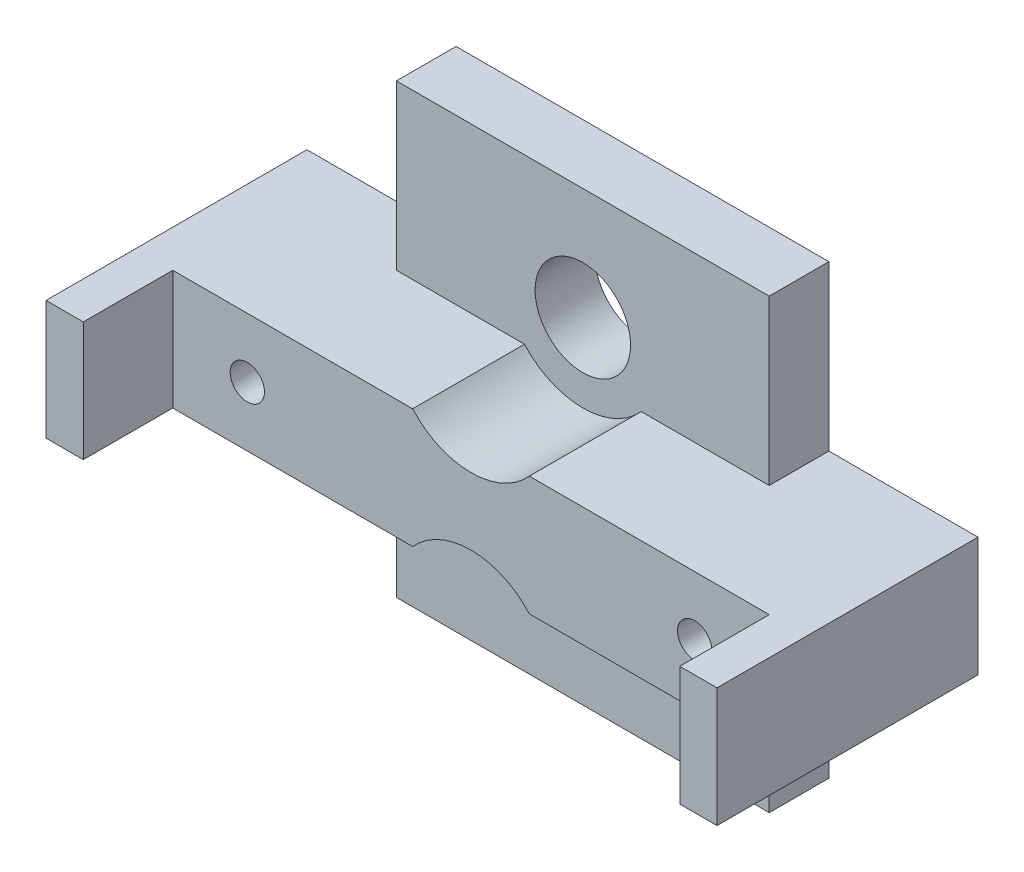
ISO-10303-21;
HEADER;
FILE_DESCRIPTION(('STEP AP214'),'2;1');
FILE_NAME('part.step','',(''),(''),'','','');
FILE_SCHEMA(('AUTOMOTIVE_DESIGN { 1 0 10303 214 1 1 1 1 }'));
ENDSEC;
DATA;
#1=APPLICATION_CONTEXT('core data for automotive mechanical design processes');
#2=APPLICATION_PROTOCOL_DEFINITION('international standard','automotive_design',2000,#1);
#3=PRODUCT_CONTEXT('',#1,'mechanical');
#4=PRODUCT('Part','Part','',(#3));
#5=PRODUCT_RELATED_PRODUCT_CATEGORY('part','',(#4));
#6=PRODUCT_DEFINITION_FORMATION('','',#4);
#7=PRODUCT_DEFINITION_CONTEXT('part definition',#1,'design');
#8=PRODUCT_DEFINITION('design','',#6,#7);
#9=PRODUCT_DEFINITION_SHAPE('','',#8);
#10=(LENGTH_UNIT() NAMED_UNIT(*) SI_UNIT(.MILLI.,.METRE.));
#11=(NAMED_UNIT(*) PLANE_ANGLE_UNIT() SI_UNIT($,.RADIAN.));
#12=(NAMED_UNIT(*) SI_UNIT($,.STERADIAN.) SOLID_ANGLE_UNIT());
#13=UNCERTAINTY_MEASURE_WITH_UNIT(LENGTH_MEASURE(1.E-05),#10,'distance_accuracy_value','');
#14=(GEOMETRIC_REPRESENTATION_CONTEXT(3) GLOBAL_UNCERTAINTY_ASSIGNED_CONTEXT((#13)) GLOBAL_UNIT_ASSIGNED_CONTEXT((#10,
#11,#12)) REPRESENTATION_CONTEXT('',''));
#15=CARTESIAN_POINT('',(0.,0.,0.));
#16=DIRECTION('',(0.,0.,1.));
#17=DIRECTION('',(1.,0.,0.));
#18=AXIS2_PLACEMENT_3D('',#15,#16,#17);
#19=CARTESIAN_POINT('',(-20.,-4.,11.5));
#20=DIRECTION('',(0.,1.,0.));
#21=DIRECTION('',(-1.,0.,0.));
#22=AXIS2_PLACEMENT_3D('',#19,#20,#21);
#23=PLANE('',#22);
#24=DIRECTION('',(0.,0.,-1.));
#25=VECTOR('',#24,1.);
#26=CARTESIAN_POINT('',(3.91311896062464,-4.,26.3492424049175));
#27=LINE('',#26,#25);
#28=CARTESIAN_POINT('',(3.91311896062464,-4.,4.));
#29=VERTEX_POINT('',#28);
#30=CARTESIAN_POINT('',(3.91311896062464,-4.,11.5));
#31=VERTEX_POINT('',#30);
#32=EDGE_CURVE('E51',#29,#31,#27,.F.);
#33=ORIENTED_EDGE('',*,*,#32,.F.);
#34=DIRECTION('',(-1.,0.,0.));
#35=VECTOR('',#34,1.);
#36=CARTESIAN_POINT('',(0.,-4.,4.));
#37=LINE('',#36,#35);
#38=CARTESIAN_POINT('',(12.5,-4.,4.));
#39=VERTEX_POINT('',#38);
#40=EDGE_CURVE('E456',#39,#29,#37,.T.);
#41=ORIENTED_EDGE('',*,*,#40,.F.);
#42=DIRECTION('',(0.,0.,-1.));
#43=VECTOR('',#42,1.);
#44=CARTESIAN_POINT('',(12.5,-4.00000000000001,4.));
#45=LINE('',#44,#43);
#46=CARTESIAN_POINT('',(12.5,-4.,0.));
#47=VERTEX_POINT('',#46);
#48=EDGE_CURVE('E11',#39,#47,#45,.T.);
#49=ORIENTED_EDGE('',*,*,#48,.T.);
#50=DIRECTION('',(-1.,0.,0.));
#51=VECTOR('',#50,1.);
#52=CARTESIAN_POINT('',(-20.,-4.,0.));
#53=LINE('',#52,#51);
#54=CARTESIAN_POINT('',(22.5,-4.00000000000001,0.));
#55=VERTEX_POINT('',#54);
#56=EDGE_CURVE('E423',#55,#47,#53,.T.);
#57=ORIENTED_EDGE('',*,*,#56,.F.);
#58=DIRECTION('',(0.,0.,-1.));
#59=VECTOR('',#58,1.);
#60=CARTESIAN_POINT('',(22.5,-4.00000000000001,17.5));
#61=LINE('',#60,#59);
#62=CARTESIAN_POINT('',(22.5,-4.00000000000001,17.5));
#63=VERTEX_POINT('',#62);
#64=EDGE_CURVE('E281',#63,#55,#61,.T.);
#65=ORIENTED_EDGE('',*,*,#64,.F.);
#66=DIRECTION('',(-1.,0.,0.));
#67=VECTOR('',#66,1.);
#68=CARTESIAN_POINT('',(20.,-4.00000000000001,17.5));
#69=LINE('',#68,#67);
#70=CARTESIAN_POINT('',(20.,-4.00000000000001,17.5));
#71=VERTEX_POINT('',#70);
#72=EDGE_CURVE('E257',#63,#71,#69,.T.);
#73=ORIENTED_EDGE('',*,*,#72,.T.);
#74=DIRECTION('',(0.,0.,-1.));
#75=VECTOR('',#74,1.);
#76=CARTESIAN_POINT('',(20.,-4.00000000000001,17.5));
#77=LINE('',#76,#75);
#78=CARTESIAN_POINT('',(20.,-4.00000000000001,11.5));
#79=VERTEX_POINT('',#78);
#80=EDGE_CURVE('E271',#71,#79,#77,.T.);
#81=ORIENTED_EDGE('',*,*,#80,.T.);
#82=DIRECTION('',(1.,0.,0.));
#83=VECTOR('',#82,1.);
#84=CARTESIAN_POINT('',(-20.,-4.,11.5));
#85=LINE('',#84,#83);
#86=EDGE_CURVE('E440',#31,#79,#85,.T.);
#87=ORIENTED_EDGE('',*,*,#86,.F.);
#88=EDGE_LOOP('',(#33,#41,#49,#57,#65,#73,#81,#87));
#89=FACE_BOUND('',#88,.T.);
#90=ADVANCED_FACE('F34',(#89),#23,.F.);
#91=DIRECTION('',(0.,0.,-1.));
#92=VECTOR('',#91,1.);
#93=CARTESIAN_POINT('',(-3.91311896062463,-4.,26.3492424049175));
#94=LINE('',#93,#92);
#95=CARTESIAN_POINT('',(-3.91311896062463,-4.,11.5));
#96=VERTEX_POINT('',#95);
#97=CARTESIAN_POINT('',(-3.91311896062463,-4.,4.));
#98=VERTEX_POINT('',#97);
#99=EDGE_CURVE('E315',#96,#98,#94,.T.);
#100=ORIENTED_EDGE('',*,*,#99,.F.);
#101=CARTESIAN_POINT('',(-20.,-4.,11.5));
#102=VERTEX_POINT('',#101);
#103=EDGE_CURVE('E441',#102,#96,#85,.T.);
#104=ORIENTED_EDGE('',*,*,#103,.F.);
#105=DIRECTION('',(0.,0.,-1.));
#106=VECTOR('',#105,1.);
#107=CARTESIAN_POINT('',(-20.,-4.,17.5));
#108=LINE('',#107,#106);
#109=CARTESIAN_POINT('',(-20.,-4.,17.5));
#110=VERTEX_POINT('',#109);
#111=EDGE_CURVE('E297',#110,#102,#108,.T.);
#112=ORIENTED_EDGE('',*,*,#111,.F.);
#113=DIRECTION('',(-1.,0.,0.));
#114=VECTOR('',#113,1.);
#115=CARTESIAN_POINT('',(-20.,-4.,17.5));
#116=LINE('',#115,#114);
#117=CARTESIAN_POINT('',(-22.5,-4.,17.5));
#118=VERTEX_POINT('',#117);
#119=EDGE_CURVE('E288',#110,#118,#116,.T.);
#120=ORIENTED_EDGE('',*,*,#119,.T.);
#121=DIRECTION('',(0.,0.,-1.));
#122=VECTOR('',#121,1.);
#123=CARTESIAN_POINT('',(-22.5,-4.,17.5));
#124=LINE('',#123,#122);
#125=CARTESIAN_POINT('',(-22.5,-4.,0.));
#126=VERTEX_POINT('',#125);
#127=EDGE_CURVE('E307',#118,#126,#124,.T.);
#128=ORIENTED_EDGE('',*,*,#127,.T.);
#129=CARTESIAN_POINT('',(-12.5,-4.,0.));
#130=VERTEX_POINT('',#129);
#131=EDGE_CURVE('E427',#130,#126,#53,.T.);
#132=ORIENTED_EDGE('',*,*,#131,.F.);
#133=DIRECTION('',(0.,0.,1.));
#134=VECTOR('',#133,1.);
#135=CARTESIAN_POINT('',(-12.5,-4.,4.));
#136=LINE('',#135,#134);
#137=CARTESIAN_POINT('',(-12.5,-3.99999999999999,4.));
#138=VERTEX_POINT('',#137);
#139=EDGE_CURVE('E459',#130,#138,#136,.T.);
#140=ORIENTED_EDGE('',*,*,#139,.T.);
#141=EDGE_CURVE('E455',#98,#138,#37,.T.);
#142=ORIENTED_EDGE('',*,*,#141,.F.);
#143=EDGE_LOOP('',(#100,#104,#112,#120,#128,#132,#140,#142));
#144=FACE_BOUND('',#143,.T.);
#145=ADVANCED_FACE('F539',(#144),#23,.F.);
#146=CARTESIAN_POINT('',(-20.,4.,11.5));
#147=DIRECTION('',(0.,-1.,0.));
#148=DIRECTION('',(1.,0.,0.));
#149=AXIS2_PLACEMENT_3D('',#146,#147,#148);
#150=PLANE('',#149);
#151=DIRECTION('',(0.,0.,-1.));
#152=VECTOR('',#151,1.);
#153=CARTESIAN_POINT('',(-3.91311896062463,4.,26.3492424049175));
#154=LINE('',#153,#152);
#155=CARTESIAN_POINT('',(-3.91311896062463,4.,4.));
#156=VERTEX_POINT('',#155);
#157=CARTESIAN_POINT('',(-3.91311896062463,4.,11.5));
#158=VERTEX_POINT('',#157);
#159=EDGE_CURVE('E59',#156,#158,#154,.F.);
#160=ORIENTED_EDGE('',*,*,#159,.F.);
#161=DIRECTION('',(1.,0.,0.));
#162=VECTOR('',#161,1.);
#163=CARTESIAN_POINT('',(0.,4.,4.));
#164=LINE('',#163,#162);
#165=CARTESIAN_POINT('',(-12.5,4.00000000000001,4.));
#166=VERTEX_POINT('',#165);
#167=EDGE_CURVE('E449',#166,#156,#164,.T.);
#168=ORIENTED_EDGE('',*,*,#167,.F.);
#169=DIRECTION('',(0.,0.,-1.));
#170=VECTOR('',#169,1.);
#171=CARTESIAN_POINT('',(-12.5,4.,4.));
#172=LINE('',#171,#170);
#173=CARTESIAN_POINT('',(-12.5,4.00000000000001,0.));
#174=VERTEX_POINT('',#173);
#175=EDGE_CURVE('E452',#166,#174,#172,.T.);
#176=ORIENTED_EDGE('',*,*,#175,.T.);
#177=DIRECTION('',(1.,0.,0.));
#178=VECTOR('',#177,1.);
#179=CARTESIAN_POINT('',(-20.,4.,0.));
#180=LINE('',#179,#178);
#181=CARTESIAN_POINT('',(-22.5,4.,0.));
#182=VERTEX_POINT('',#181);
#183=EDGE_CURVE('E428',#182,#174,#180,.T.);
#184=ORIENTED_EDGE('',*,*,#183,.F.);
#185=DIRECTION('',(0.,0.,-1.));
#186=VECTOR('',#185,1.);
#187=CARTESIAN_POINT('',(-22.5,4.,17.5));
#188=LINE('',#187,#186);
#189=CARTESIAN_POINT('',(-22.5,4.,17.5));
#190=VERTEX_POINT('',#189);
#191=EDGE_CURVE('E304',#190,#182,#188,.T.);
#192=ORIENTED_EDGE('',*,*,#191,.F.);
#193=DIRECTION('',(1.,0.,0.));
#194=VECTOR('',#193,1.);
#195=CARTESIAN_POINT('',(-20.,4.,17.5));
#196=LINE('',#195,#194);
#197=CARTESIAN_POINT('',(-20.,4.,17.5));
#198=VERTEX_POINT('',#197);
#199=EDGE_CURVE('E294',#190,#198,#196,.T.);
#200=ORIENTED_EDGE('',*,*,#199,.T.);
#201=DIRECTION('',(0.,0.,-1.));
#202=VECTOR('',#201,1.);
#203=CARTESIAN_POINT('',(-20.,4.,17.5));
#204=LINE('',#203,#202);
#205=CARTESIAN_POINT('',(-20.,4.,11.5));
#206=VERTEX_POINT('',#205);
#207=EDGE_CURVE('E300',#198,#206,#204,.T.);
#208=ORIENTED_EDGE('',*,*,#207,.T.);
#209=DIRECTION('',(-1.,0.,0.));
#210=VECTOR('',#209,1.);
#211=CARTESIAN_POINT('',(-20.,4.,11.5));
#212=LINE('',#211,#210);
#213=EDGE_CURVE('E446',#158,#206,#212,.T.);
#214=ORIENTED_EDGE('',*,*,#213,.F.);
#215=EDGE_LOOP('',(#160,#168,#176,#184,#192,#200,#208,#214));
#216=FACE_BOUND('',#215,.T.);
#217=ADVANCED_FACE('F548',(#216),#150,.F.);
#218=DIRECTION('',(0.,0.,-1.));
#219=VECTOR('',#218,1.);
#220=CARTESIAN_POINT('',(3.91311896062464,4.,26.3492424049175));
#221=LINE('',#220,#219);
#222=CARTESIAN_POINT('',(3.91311896062464,4.,11.5));
#223=VERTEX_POINT('',#222);
#224=CARTESIAN_POINT('',(3.91311896062464,4.,4.));
#225=VERTEX_POINT('',#224);
#226=EDGE_CURVE('E323',#223,#225,#221,.T.);
#227=ORIENTED_EDGE('',*,*,#226,.F.);
#228=CARTESIAN_POINT('',(20.,4.00000000000001,11.5));
#229=VERTEX_POINT('',#228);
#230=EDGE_CURVE('E252',#229,#223,#212,.T.);
#231=ORIENTED_EDGE('',*,*,#230,.F.);
#232=DIRECTION('',(0.,0.,-1.));
#233=VECTOR('',#232,1.);
#234=CARTESIAN_POINT('',(20.,4.00000000000001,17.5));
#235=LINE('',#234,#233);
#236=CARTESIAN_POINT('',(20.,4.00000000000001,17.5));
#237=VERTEX_POINT('',#236);
#238=EDGE_CURVE('E245',#237,#229,#235,.T.);
#239=ORIENTED_EDGE('',*,*,#238,.F.);
#240=DIRECTION('',(1.,0.,0.));
#241=VECTOR('',#240,1.);
#242=CARTESIAN_POINT('',(20.,4.00000000000001,17.5));
#243=LINE('',#242,#241);
#244=CARTESIAN_POINT('',(22.5,4.,17.5));
#245=VERTEX_POINT('',#244);
#246=EDGE_CURVE('E250',#237,#245,#243,.T.);
#247=ORIENTED_EDGE('',*,*,#246,.T.);
#248=DIRECTION('',(0.,0.,-1.));
#249=VECTOR('',#248,1.);
#250=CARTESIAN_POINT('',(22.5,4.,17.5));
#251=LINE('',#250,#249);
#252=CARTESIAN_POINT('',(22.5,4.,0.));
#253=VERTEX_POINT('',#252);
#254=EDGE_CURVE('E256',#245,#253,#251,.T.);
#255=ORIENTED_EDGE('',*,*,#254,.T.);
#256=CARTESIAN_POINT('',(12.5,4.00000000000001,0.));
#257=VERTEX_POINT('',#256);
#258=EDGE_CURVE('E431',#257,#253,#180,.T.);
#259=ORIENTED_EDGE('',*,*,#258,.F.);
#260=DIRECTION('',(0.,0.,1.));
#261=VECTOR('',#260,1.);
#262=CARTESIAN_POINT('',(12.5,4.00000000000001,4.));
#263=LINE('',#262,#261);
#264=CARTESIAN_POINT('',(12.5,4.00000000000001,4.));
#265=VERTEX_POINT('',#264);
#266=EDGE_CURVE('E43',#257,#265,#263,.T.);
#267=ORIENTED_EDGE('',*,*,#266,.T.);
#268=EDGE_CURVE('E448',#225,#265,#164,.T.);
#269=ORIENTED_EDGE('',*,*,#268,.F.);
#270=EDGE_LOOP('',(#227,#231,#239,#247,#255,#259,#267,#269));
#271=FACE_BOUND('',#270,.T.);
#272=ADVANCED_FACE('F248',(#271),#150,.F.);
#273=CARTESIAN_POINT('',(15.,0.,11.5));
#274=DIRECTION('',(0.,0.,-1.));
#275=DIRECTION('',(-1.,0.,0.));
#276=AXIS2_PLACEMENT_3D('',#273,#274,#275);
#277=CYLINDRICAL_SURFACE('',#276,1.15);
#278=CARTESIAN_POINT('',(15.,0.,11.5));
#279=DIRECTION('',(0.,0.,1.));
#280=DIRECTION('',(1.,0.,0.));
#281=AXIS2_PLACEMENT_3D('',#278,#279,#280);
#282=CIRCLE('',#281,1.15);
#283=CARTESIAN_POINT('',(16.15,0.,11.5));
#284=VERTEX_POINT('',#283);
#285=EDGE_CURVE('E434',#284,#284,#282,.T.);
#286=ORIENTED_EDGE('',*,*,#285,.T.);
#287=EDGE_LOOP('',(#286));
#288=FACE_BOUND('',#287,.T.);
#289=CARTESIAN_POINT('',(15.,0.,9.5));
#290=DIRECTION('',(0.,0.,-1.));
#291=DIRECTION('',(-1.,0.,0.));
#292=AXIS2_PLACEMENT_3D('',#289,#290,#291);
#293=CIRCLE('',#292,1.15);
#294=CARTESIAN_POINT('',(13.85,0.,9.5));
#295=VERTEX_POINT('',#294);
#296=EDGE_CURVE('E38',#295,#295,#293,.T.);
#297=ORIENTED_EDGE('',*,*,#296,.T.);
#298=EDGE_LOOP('',(#297));
#299=FACE_BOUND('',#298,.T.);
#300=ADVANCED_FACE('F793',(#288,#299),#277,.F.);
#301=CARTESIAN_POINT('',(-15.,0.,11.5));
#302=DIRECTION('',(0.,0.,-1.));
#303=DIRECTION('',(-1.,0.,0.));
#304=AXIS2_PLACEMENT_3D('',#301,#302,#303);
#305=CYLINDRICAL_SURFACE('',#304,1.15);
#306=CARTESIAN_POINT('',(-15.,0.,11.5));
#307=DIRECTION('',(0.,0.,1.));
#308=DIRECTION('',(1.,0.,0.));
#309=AXIS2_PLACEMENT_3D('',#306,#307,#308);
#310=CIRCLE('',#309,1.15);
#311=CARTESIAN_POINT('',(-13.85,0.,11.5));
#312=VERTEX_POINT('',#311);
#313=EDGE_CURVE('E426',#312,#312,#310,.T.);
#314=ORIENTED_EDGE('',*,*,#313,.T.);
#315=EDGE_LOOP('',(#314));
#316=FACE_BOUND('',#315,.T.);
#317=CARTESIAN_POINT('',(-15.,0.,9.5));
#318=DIRECTION('',(0.,0.,-1.));
#319=DIRECTION('',(-1.,0.,0.));
#320=AXIS2_PLACEMENT_3D('',#317,#318,#319);
#321=CIRCLE('',#320,1.15);
#322=CARTESIAN_POINT('',(-16.15,0.,9.5));
#323=VERTEX_POINT('',#322);
#324=EDGE_CURVE('E412',#323,#323,#321,.T.);
#325=ORIENTED_EDGE('',*,*,#324,.T.);
#326=EDGE_LOOP('',(#325));
#327=FACE_BOUND('',#326,.T.);
#328=ADVANCED_FACE('F607',(#316,#327),#305,.F.);
#329=CARTESIAN_POINT('',(0.,0.,4.));
#330=DIRECTION('',(0.,0.,1.));
#331=DIRECTION('',(1.,0.,0.));
#332=AXIS2_PLACEMENT_3D('',#329,#330,#331);
#333=PLANE('',#332);
#334=ORIENTED_EDGE('',*,*,#40,.T.);
#335=CARTESIAN_POINT('',(0.,-7.5,4.));
#336=DIRECTION('',(0.,0.,1.));
#337=DIRECTION('',(1.,0.,0.));
#338=AXIS2_PLACEMENT_3D('',#335,#336,#337);
#339=CIRCLE('',#338,5.25);
#340=EDGE_CURVE('E303',#29,#98,#339,.T.);
#341=ORIENTED_EDGE('',*,*,#340,.T.);
#342=ORIENTED_EDGE('',*,*,#141,.T.);
#343=DIRECTION('',(0.,-1.,0.));
#344=VECTOR('',#343,1.);
#345=CARTESIAN_POINT('',(-12.5,15.,4.));
#346=LINE('',#345,#344);
#347=CARTESIAN_POINT('',(-12.5,-15.,4.));
#348=VERTEX_POINT('',#347);
#349=EDGE_CURVE('E479',#138,#348,#346,.T.);
#350=ORIENTED_EDGE('',*,*,#349,.T.);
#351=DIRECTION('',(1.,0.,0.));
#352=VECTOR('',#351,1.);
#353=CARTESIAN_POINT('',(-12.5,-15.,4.));
#354=LINE('',#353,#352);
#355=CARTESIAN_POINT('',(12.5,-15.,4.));
#356=VERTEX_POINT('',#355);
#357=EDGE_CURVE('E478',#348,#356,#354,.T.);
#358=ORIENTED_EDGE('',*,*,#357,.T.);
#359=DIRECTION('',(0.,1.,0.));
#360=VECTOR('',#359,1.);
#361=CARTESIAN_POINT('',(12.5,15.,4.));
#362=LINE('',#361,#360);
#363=EDGE_CURVE('E482',#356,#39,#362,.T.);
#364=ORIENTED_EDGE('',*,*,#363,.T.);
#365=EDGE_LOOP('',(#334,#341,#342,#350,#358,#364));
#366=FACE_BOUND('',#365,.T.);
#367=CARTESIAN_POINT('',(0.,-7.5,4.));
#368=DIRECTION('',(0.,0.,1.));
#369=DIRECTION('',(1.,0.,0.));
#370=AXIS2_PLACEMENT_3D('',#367,#368,#369);
#371=CIRCLE('',#370,3.2);
#372=CARTESIAN_POINT('',(3.2,-7.5,4.));
#373=VERTEX_POINT('',#372);
#374=EDGE_CURVE('E463',#373,#373,#371,.T.);
#375=ORIENTED_EDGE('',*,*,#374,.F.);
#376=EDGE_LOOP('',(#375));
#377=FACE_BOUND('',#376,.T.);
#378=ADVANCED_FACE('F574',(#366,#377),#333,.T.);
#379=ORIENTED_EDGE('',*,*,#167,.T.);
#380=CARTESIAN_POINT('',(0.,7.5,4.));
#381=DIRECTION('',(0.,0.,1.));
#382=DIRECTION('',(1.,0.,0.));
#383=AXIS2_PLACEMENT_3D('',#380,#381,#382);
#384=CIRCLE('',#383,5.25);
#385=EDGE_CURVE('E318',#156,#225,#384,.T.);
#386=ORIENTED_EDGE('',*,*,#385,.T.);
#387=ORIENTED_EDGE('',*,*,#268,.T.);
#388=CARTESIAN_POINT('',(12.5,15.,4.));
#389=VERTEX_POINT('',#388);
#390=EDGE_CURVE('E481',#265,#389,#362,.T.);
#391=ORIENTED_EDGE('',*,*,#390,.T.);
#392=DIRECTION('',(-1.,0.,0.));
#393=VECTOR('',#392,1.);
#394=CARTESIAN_POINT('',(-12.5,15.,4.));
#395=LINE('',#394,#393);
#396=CARTESIAN_POINT('',(-12.5,15.,4.));
#397=VERTEX_POINT('',#396);
#398=EDGE_CURVE('E485',#389,#397,#395,.T.);
#399=ORIENTED_EDGE('',*,*,#398,.T.);
#400=EDGE_CURVE('E475',#397,#166,#346,.T.);
#401=ORIENTED_EDGE('',*,*,#400,.T.);
#402=EDGE_LOOP('',(#379,#386,#387,#391,#399,#401));
#403=FACE_BOUND('',#402,.T.);
#404=CARTESIAN_POINT('',(0.,7.5,4.));
#405=DIRECTION('',(0.,0.,1.));
#406=DIRECTION('',(1.,0.,0.));
#407=AXIS2_PLACEMENT_3D('',#404,#405,#406);
#408=CIRCLE('',#407,3.2);
#409=CARTESIAN_POINT('',(3.2,7.5,4.));
#410=VERTEX_POINT('',#409);
#411=EDGE_CURVE('E469',#410,#410,#408,.T.);
#412=ORIENTED_EDGE('',*,*,#411,.F.);
#413=EDGE_LOOP('',(#412));
#414=FACE_BOUND('',#413,.T.);
#415=ADVANCED_FACE('F554',(#403,#414),#333,.T.);
#416=CARTESIAN_POINT('',(-12.5,15.,4.));
#417=DIRECTION('',(1.,0.,0.));
#418=DIRECTION('',(0.,0.,-1.));
#419=AXIS2_PLACEMENT_3D('',#416,#417,#418);
#420=PLANE('',#419);
#421=ORIENTED_EDGE('',*,*,#139,.F.);
#422=DIRECTION('',(0.,-1.,0.));
#423=VECTOR('',#422,1.);
#424=CARTESIAN_POINT('',(-12.5,15.,0.));
#425=LINE('',#424,#423);
#426=CARTESIAN_POINT('',(-12.5,-15.,0.));
#427=VERTEX_POINT('',#426);
#428=EDGE_CURVE('E472',#130,#427,#425,.T.);
#429=ORIENTED_EDGE('',*,*,#428,.T.);
#430=DIRECTION('',(0.,0.,-1.));
#431=VECTOR('',#430,1.);
#432=CARTESIAN_POINT('',(-12.5,-15.,4.));
#433=LINE('',#432,#431);
#434=EDGE_CURVE('E505',#348,#427,#433,.T.);
#435=ORIENTED_EDGE('',*,*,#434,.F.);
#436=ORIENTED_EDGE('',*,*,#349,.F.);
#437=EDGE_LOOP('',(#421,#429,#435,#436));
#438=FACE_BOUND('',#437,.T.);
#439=ADVANCED_FACE('F36',(#438),#420,.F.);
#440=ORIENTED_EDGE('',*,*,#175,.F.);
#441=ORIENTED_EDGE('',*,*,#400,.F.);
#442=DIRECTION('',(0.,0.,-1.));
#443=VECTOR('',#442,1.);
#444=CARTESIAN_POINT('',(-12.5,15.,4.));
#445=LINE('',#444,#443);
#446=CARTESIAN_POINT('',(-12.5,15.,0.));
#447=VERTEX_POINT('',#446);
#448=EDGE_CURVE('E487',#397,#447,#445,.T.);
#449=ORIENTED_EDGE('',*,*,#448,.T.);
#450=EDGE_CURVE('E488',#447,#174,#425,.T.);
#451=ORIENTED_EDGE('',*,*,#450,.T.);
#452=EDGE_LOOP('',(#440,#441,#449,#451));
#453=FACE_BOUND('',#452,.T.);
#454=ADVANCED_FACE('F552',(#453),#420,.F.);
#455=CARTESIAN_POINT('',(12.5,15.,4.));
#456=DIRECTION('',(-1.,0.,0.));
#457=DIRECTION('',(0.,-1.,0.));
#458=AXIS2_PLACEMENT_3D('',#455,#456,#457);
#459=PLANE('',#458);
#460=ORIENTED_EDGE('',*,*,#48,.F.);
#461=ORIENTED_EDGE('',*,*,#363,.F.);
#462=DIRECTION('',(0.,0.,-1.));
#463=VECTOR('',#462,1.);
#464=CARTESIAN_POINT('',(12.5,-15.,4.));
#465=LINE('',#464,#463);
#466=CARTESIAN_POINT('',(12.5,-15.,0.));
#467=VERTEX_POINT('',#466);
#468=EDGE_CURVE('E502',#356,#467,#465,.T.);
#469=ORIENTED_EDGE('',*,*,#468,.T.);
#470=DIRECTION('',(0.,1.,0.));
#471=VECTOR('',#470,1.);
#472=CARTESIAN_POINT('',(12.5,15.,0.));
#473=LINE('',#472,#471);
#474=EDGE_CURVE('E493',#467,#47,#473,.T.);
#475=ORIENTED_EDGE('',*,*,#474,.T.);
#476=EDGE_LOOP('',(#460,#461,#469,#475));
#477=FACE_BOUND('',#476,.T.);
#478=ADVANCED_FACE('F527',(#477),#459,.F.);
#479=ORIENTED_EDGE('',*,*,#266,.F.);
#480=CARTESIAN_POINT('',(12.5,15.,0.));
#481=VERTEX_POINT('',#480);
#482=EDGE_CURVE('E492',#257,#481,#473,.T.);
#483=ORIENTED_EDGE('',*,*,#482,.T.);
#484=DIRECTION('',(0.,0.,-1.));
#485=VECTOR('',#484,1.);
#486=CARTESIAN_POINT('',(12.5,15.,4.));
#487=LINE('',#486,#485);
#488=EDGE_CURVE('E499',#389,#481,#487,.T.);
#489=ORIENTED_EDGE('',*,*,#488,.F.);
#490=ORIENTED_EDGE('',*,*,#390,.F.);
#491=EDGE_LOOP('',(#479,#483,#489,#490));
#492=FACE_BOUND('',#491,.T.);
#493=ADVANCED_FACE('F563',(#492),#459,.F.);
#494=CARTESIAN_POINT('',(0.,0.,0.));
#495=DIRECTION('',(0.,0.,1.));
#496=DIRECTION('',(1.,0.,0.));
#497=AXIS2_PLACEMENT_3D('',#494,#495,#496);
#498=PLANE('',#497);
#499=DIRECTION('',(0.5,0.866025403784438,0.));
#500=VECTOR('',#499,1.);
#501=CARTESIAN_POINT('',(12.5173938424846,0.,0.));
#502=LINE('',#501,#500);
#503=CARTESIAN_POINT('',(12.5173938424846,0.,0.));
#504=VERTEX_POINT('',#503);
#505=CARTESIAN_POINT('',(13.7586969212423,2.15,0.));
#506=VERTEX_POINT('',#505);
#507=EDGE_CURVE('E348',#504,#506,#502,.T.);
#508=ORIENTED_EDGE('',*,*,#507,.F.);
#509=DIRECTION('',(-0.5,0.866025403784439,0.));
#510=VECTOR('',#509,1.);
#511=CARTESIAN_POINT('',(13.7586969212423,-2.15,0.));
#512=LINE('',#511,#510);
#513=CARTESIAN_POINT('',(13.7586969212423,-2.15,0.));
#514=VERTEX_POINT('',#513);
#515=EDGE_CURVE('E326',#514,#504,#512,.T.);
#516=ORIENTED_EDGE('',*,*,#515,.F.);
#517=DIRECTION('',(-1.,0.,0.));
#518=VECTOR('',#517,1.);
#519=CARTESIAN_POINT('',(16.2413030787577,-2.15,0.));
#520=LINE('',#519,#518);
#521=CARTESIAN_POINT('',(16.2413030787577,-2.15,0.));
#522=VERTEX_POINT('',#521);
#523=EDGE_CURVE('E331',#522,#514,#520,.T.);
#524=ORIENTED_EDGE('',*,*,#523,.F.);
#525=DIRECTION('',(-0.5,-0.866025403784438,0.));
#526=VECTOR('',#525,1.);
#527=CARTESIAN_POINT('',(17.4826061575154,0.,0.));
#528=LINE('',#527,#526);
#529=CARTESIAN_POINT('',(17.4826061575154,0.,0.));
#530=VERTEX_POINT('',#529);
#531=EDGE_CURVE('E357',#530,#522,#528,.T.);
#532=ORIENTED_EDGE('',*,*,#531,.F.);
#533=DIRECTION('',(0.5,-0.866025403784439,0.));
#534=VECTOR('',#533,1.);
#535=CARTESIAN_POINT('',(16.2413030787577,2.15,0.));
#536=LINE('',#535,#534);
#537=CARTESIAN_POINT('',(16.2413030787577,2.15,0.));
#538=VERTEX_POINT('',#537);
#539=EDGE_CURVE('E354',#538,#530,#536,.T.);
#540=ORIENTED_EDGE('',*,*,#539,.F.);
#541=DIRECTION('',(1.,0.,0.));
#542=VECTOR('',#541,1.);
#543=CARTESIAN_POINT('',(13.7586969212423,2.15,0.));
#544=LINE('',#543,#542);
#545=EDGE_CURVE('E351',#506,#538,#544,.T.);
#546=ORIENTED_EDGE('',*,*,#545,.F.);
#547=EDGE_LOOP('',(#508,#516,#524,#532,#540,#546));
#548=FACE_BOUND('',#547,.T.);
#549=DIRECTION('',(0.5,0.866025403784439,0.));
#550=VECTOR('',#549,1.);
#551=CARTESIAN_POINT('',(-17.4826061575154,0.,0.));
#552=LINE('',#551,#550);
#553=CARTESIAN_POINT('',(-17.4826061575154,0.,0.));
#554=VERTEX_POINT('',#553);
#555=CARTESIAN_POINT('',(-16.2413030787577,2.15,0.));
#556=VERTEX_POINT('',#555);
#557=EDGE_CURVE('E396',#554,#556,#552,.T.);
#558=ORIENTED_EDGE('',*,*,#557,.F.);
#559=DIRECTION('',(-0.5,0.866025403784439,0.));
#560=VECTOR('',#559,1.);
#561=CARTESIAN_POINT('',(-16.2413030787577,-2.15,0.));
#562=LINE('',#561,#560);
#563=CARTESIAN_POINT('',(-16.2413030787577,-2.15,0.));
#564=VERTEX_POINT('',#563);
#565=EDGE_CURVE('E394',#564,#554,#562,.T.);
#566=ORIENTED_EDGE('',*,*,#565,.F.);
#567=DIRECTION('',(-1.,0.,0.));
#568=VECTOR('',#567,1.);
#569=CARTESIAN_POINT('',(-13.7586969212423,-2.15,0.));
#570=LINE('',#569,#568);
#571=CARTESIAN_POINT('',(-13.7586969212423,-2.15,0.));
#572=VERTEX_POINT('',#571);
#573=EDGE_CURVE('E378',#572,#564,#570,.T.);
#574=ORIENTED_EDGE('',*,*,#573,.F.);
#575=DIRECTION('',(-0.5,-0.866025403784439,0.));
#576=VECTOR('',#575,1.);
#577=CARTESIAN_POINT('',(-12.5173938424846,0.,0.));
#578=LINE('',#577,#576);
#579=CARTESIAN_POINT('',(-12.5173938424846,0.,0.));
#580=VERTEX_POINT('',#579);
#581=EDGE_CURVE('E405',#580,#572,#578,.T.);
#582=ORIENTED_EDGE('',*,*,#581,.F.);
#583=DIRECTION('',(0.5,-0.866025403784439,0.));
#584=VECTOR('',#583,1.);
#585=CARTESIAN_POINT('',(-13.7586969212423,2.15,0.));
#586=LINE('',#585,#584);
#587=CARTESIAN_POINT('',(-13.7586969212423,2.15,0.));
#588=VERTEX_POINT('',#587);
#589=EDGE_CURVE('E402',#588,#580,#586,.T.);
#590=ORIENTED_EDGE('',*,*,#589,.F.);
#591=DIRECTION('',(1.,0.,0.));
#592=VECTOR('',#591,1.);
#593=CARTESIAN_POINT('',(-16.2413030787577,2.15,0.));
#594=LINE('',#593,#592);
#595=EDGE_CURVE('E399',#556,#588,#594,.T.);
#596=ORIENTED_EDGE('',*,*,#595,.F.);
#597=EDGE_LOOP('',(#558,#566,#574,#582,#590,#596));
#598=FACE_BOUND('',#597,.T.);
#599=ORIENTED_EDGE('',*,*,#183,.T.);
#600=ORIENTED_EDGE('',*,*,#450,.F.);
#601=DIRECTION('',(-1.,0.,0.));
#602=VECTOR('',#601,1.);
#603=CARTESIAN_POINT('',(-12.5,15.,0.));
#604=LINE('',#603,#602);
#605=EDGE_CURVE('E495',#481,#447,#604,.T.);
#606=ORIENTED_EDGE('',*,*,#605,.F.);
#607=ORIENTED_EDGE('',*,*,#482,.F.);
#608=ORIENTED_EDGE('',*,*,#258,.T.);
#609=DIRECTION('',(0.,-1.,0.));
#610=VECTOR('',#609,1.);
#611=CARTESIAN_POINT('',(22.5,4.,0.));
#612=LINE('',#611,#610);
#613=EDGE_CURVE('E272',#253,#55,#612,.T.);
#614=ORIENTED_EDGE('',*,*,#613,.T.);
#615=ORIENTED_EDGE('',*,*,#56,.T.);
#616=ORIENTED_EDGE('',*,*,#474,.F.);
#617=DIRECTION('',(1.,0.,0.));
#618=VECTOR('',#617,1.);
#619=CARTESIAN_POINT('',(-12.5,-15.,0.));
#620=LINE('',#619,#618);
#621=EDGE_CURVE('E490',#427,#467,#620,.T.);
#622=ORIENTED_EDGE('',*,*,#621,.F.);
#623=ORIENTED_EDGE('',*,*,#428,.F.);
#624=ORIENTED_EDGE('',*,*,#131,.T.);
#625=DIRECTION('',(0.,1.,0.));
#626=VECTOR('',#625,1.);
#627=CARTESIAN_POINT('',(-22.5,4.,0.));
#628=LINE('',#627,#626);
#629=EDGE_CURVE('E280',#126,#182,#628,.T.);
#630=ORIENTED_EDGE('',*,*,#629,.T.);
#631=EDGE_LOOP('',(#599,#600,#606,#607,#608,#614,#615,#616,#622,#623,#624,#630));
#632=FACE_BOUND('',#631,.T.);
#633=CARTESIAN_POINT('',(0.,7.5,0.));
#634=DIRECTION('',(0.,0.,1.));
#635=DIRECTION('',(1.,0.,0.));
#636=AXIS2_PLACEMENT_3D('',#633,#634,#635);
#637=CIRCLE('',#636,3.2);
#638=CARTESIAN_POINT('',(3.2,7.5,0.));
#639=VERTEX_POINT('',#638);
#640=EDGE_CURVE('E466',#639,#639,#637,.T.);
#641=ORIENTED_EDGE('',*,*,#640,.T.);
#642=EDGE_LOOP('',(#641));
#643=FACE_BOUND('',#642,.T.);
#644=CARTESIAN_POINT('',(0.,-7.5,0.));
#645=DIRECTION('',(0.,0.,1.));
#646=DIRECTION('',(1.,0.,0.));
#647=AXIS2_PLACEMENT_3D('',#644,#645,#646);
#648=CIRCLE('',#647,3.2);
#649=CARTESIAN_POINT('',(3.2,-7.5,0.));
#650=VERTEX_POINT('',#649);
#651=EDGE_CURVE('E462',#650,#650,#648,.T.);
#652=ORIENTED_EDGE('',*,*,#651,.T.);
#653=EDGE_LOOP('',(#652));
#654=FACE_BOUND('',#653,.T.);
#655=ADVANCED_FACE('F514',(#548,#598,#632,#643,#654),#498,.F.);
#656=CARTESIAN_POINT('',(-12.5,-15.,4.));
#657=DIRECTION('',(0.,1.,0.));
#658=DIRECTION('',(0.,0.,1.));
#659=AXIS2_PLACEMENT_3D('',#656,#657,#658);
#660=PLANE('',#659);
#661=ORIENTED_EDGE('',*,*,#621,.T.);
#662=ORIENTED_EDGE('',*,*,#468,.F.);
#663=ORIENTED_EDGE('',*,*,#357,.F.);
#664=ORIENTED_EDGE('',*,*,#434,.T.);
#665=EDGE_LOOP('',(#661,#662,#663,#664));
#666=FACE_BOUND('',#665,.T.);
#667=ADVANCED_FACE('F532',(#666),#660,.F.);
#668=CARTESIAN_POINT('',(-12.5,15.,4.));
#669=DIRECTION('',(0.,-1.,0.));
#670=DIRECTION('',(0.,0.,-1.));
#671=AXIS2_PLACEMENT_3D('',#668,#669,#670);
#672=PLANE('',#671);
#673=ORIENTED_EDGE('',*,*,#605,.T.);
#674=ORIENTED_EDGE('',*,*,#448,.F.);
#675=ORIENTED_EDGE('',*,*,#398,.F.);
#676=ORIENTED_EDGE('',*,*,#488,.T.);
#677=EDGE_LOOP('',(#673,#674,#675,#676));
#678=FACE_BOUND('',#677,.T.);
#679=ADVANCED_FACE('F561',(#678),#672,.F.);
#680=CARTESIAN_POINT('',(0.,7.5,4.));
#681=DIRECTION('',(0.,0.,-1.));
#682=DIRECTION('',(-1.,0.,0.));
#683=AXIS2_PLACEMENT_3D('',#680,#681,#682);
#684=CYLINDRICAL_SURFACE('',#683,3.2);
#685=ORIENTED_EDGE('',*,*,#411,.T.);
#686=EDGE_LOOP('',(#685));
#687=FACE_BOUND('',#686,.T.);
#688=ORIENTED_EDGE('',*,*,#640,.F.);
#689=EDGE_LOOP('',(#688));
#690=FACE_BOUND('',#689,.T.);
#691=ADVANCED_FACE('F600',(#687,#690),#684,.F.);
#692=CARTESIAN_POINT('',(0.,-7.5,4.));
#693=DIRECTION('',(0.,0.,-1.));
#694=DIRECTION('',(-1.,0.,0.));
#695=AXIS2_PLACEMENT_3D('',#692,#693,#694);
#696=CYLINDRICAL_SURFACE('',#695,3.2);
#697=ORIENTED_EDGE('',*,*,#374,.T.);
#698=EDGE_LOOP('',(#697));
#699=FACE_BOUND('',#698,.T.);
#700=ORIENTED_EDGE('',*,*,#651,.F.);
#701=EDGE_LOOP('',(#700));
#702=FACE_BOUND('',#701,.T.);
#703=ADVANCED_FACE('F597',(#699,#702),#696,.F.);
#704=CARTESIAN_POINT('',(0.,0.,11.5));
#705=DIRECTION('',(0.,0.,1.));
#706=DIRECTION('',(1.,0.,0.));
#707=AXIS2_PLACEMENT_3D('',#704,#705,#706);
#708=PLANE('',#707);
#709=ORIENTED_EDGE('',*,*,#285,.F.);
#710=EDGE_LOOP('',(#709));
#711=FACE_BOUND('',#710,.T.);
#712=ORIENTED_EDGE('',*,*,#103,.T.);
#713=CARTESIAN_POINT('',(0.,-7.5,11.5));
#714=DIRECTION('',(0.,0.,1.));
#715=DIRECTION('',(1.,0.,0.));
#716=AXIS2_PLACEMENT_3D('',#713,#714,#715);
#717=CIRCLE('',#716,5.25);
#718=EDGE_CURVE('E313',#31,#96,#717,.T.);
#719=ORIENTED_EDGE('',*,*,#718,.F.);
#720=ORIENTED_EDGE('',*,*,#86,.T.);
#721=DIRECTION('',(0.,1.,0.));
#722=VECTOR('',#721,1.);
#723=CARTESIAN_POINT('',(20.,4.00000000000001,11.5));
#724=LINE('',#723,#722);
#725=EDGE_CURVE('E444',#79,#229,#724,.T.);
#726=ORIENTED_EDGE('',*,*,#725,.T.);
#727=ORIENTED_EDGE('',*,*,#230,.T.);
#728=CARTESIAN_POINT('',(0.,7.5,11.5));
#729=DIRECTION('',(0.,0.,1.));
#730=DIRECTION('',(1.,0.,0.));
#731=AXIS2_PLACEMENT_3D('',#728,#729,#730);
#732=CIRCLE('',#731,5.25);
#733=EDGE_CURVE('E321',#158,#223,#732,.T.);
#734=ORIENTED_EDGE('',*,*,#733,.F.);
#735=ORIENTED_EDGE('',*,*,#213,.T.);
#736=DIRECTION('',(0.,-1.,0.));
#737=VECTOR('',#736,1.);
#738=CARTESIAN_POINT('',(-20.,4.,11.5));
#739=LINE('',#738,#737);
#740=EDGE_CURVE('E437',#206,#102,#739,.T.);
#741=ORIENTED_EDGE('',*,*,#740,.T.);
#742=EDGE_LOOP('',(#712,#719,#720,#726,#727,#734,#735,#741));
#743=FACE_BOUND('',#742,.T.);
#744=ORIENTED_EDGE('',*,*,#313,.F.);
#745=EDGE_LOOP('',(#744));
#746=FACE_BOUND('',#745,.T.);
#747=ADVANCED_FACE('F569',(#711,#743,#746),#708,.T.);
#748=CARTESIAN_POINT('',(-16.2413030787577,-2.15,9.5));
#749=DIRECTION('',(-0.866025403784439,-0.5,0.));
#750=DIRECTION('',(0.5,-0.866025403784439,0.));
#751=AXIS2_PLACEMENT_3D('',#748,#749,#750);
#752=PLANE('',#751);
#753=ORIENTED_EDGE('',*,*,#565,.T.);
#754=DIRECTION('',(0.,0.,-1.));
#755=VECTOR('',#754,1.);
#756=CARTESIAN_POINT('',(-17.4826061575154,0.,9.5));
#757=LINE('',#756,#755);
#758=CARTESIAN_POINT('',(-17.4826061575154,0.,9.5));
#759=VERTEX_POINT('',#758);
#760=EDGE_CURVE('E393',#759,#554,#757,.T.);
#761=ORIENTED_EDGE('',*,*,#760,.F.);
#762=DIRECTION('',(-0.5,0.866025403784439,0.));
#763=VECTOR('',#762,1.);
#764=CARTESIAN_POINT('',(-16.2413030787577,-2.15,9.5));
#765=LINE('',#764,#763);
#766=CARTESIAN_POINT('',(-16.2413030787577,-2.15,9.5));
#767=VERTEX_POINT('',#766);
#768=EDGE_CURVE('E374',#767,#759,#765,.T.);
#769=ORIENTED_EDGE('',*,*,#768,.F.);
#770=DIRECTION('',(0.,0.,-1.));
#771=VECTOR('',#770,1.);
#772=CARTESIAN_POINT('',(-16.2413030787577,-2.15,9.5));
#773=LINE('',#772,#771);
#774=EDGE_CURVE('E410',#767,#564,#773,.T.);
#775=ORIENTED_EDGE('',*,*,#774,.T.);
#776=EDGE_LOOP('',(#753,#761,#769,#775));
#777=FACE_BOUND('',#776,.T.);
#778=ADVANCED_FACE('F639',(#777),#752,.F.);
#779=CARTESIAN_POINT('',(-13.7586969212423,-2.15,9.5));
#780=DIRECTION('',(0.,-1.,0.));
#781=DIRECTION('',(1.,0.,0.));
#782=AXIS2_PLACEMENT_3D('',#779,#780,#781);
#783=PLANE('',#782);
#784=ORIENTED_EDGE('',*,*,#573,.T.);
#785=ORIENTED_EDGE('',*,*,#774,.F.);
#786=DIRECTION('',(-1.,0.,0.));
#787=VECTOR('',#786,1.);
#788=CARTESIAN_POINT('',(-13.7586969212423,-2.15,9.5));
#789=LINE('',#788,#787);
#790=CARTESIAN_POINT('',(-13.7586969212423,-2.15,9.5));
#791=VERTEX_POINT('',#790);
#792=EDGE_CURVE('E390',#791,#767,#789,.T.);
#793=ORIENTED_EDGE('',*,*,#792,.F.);
#794=DIRECTION('',(0.,0.,-1.));
#795=VECTOR('',#794,1.);
#796=CARTESIAN_POINT('',(-13.7586969212423,-2.15,9.5));
#797=LINE('',#796,#795);
#798=EDGE_CURVE('E413',#791,#572,#797,.T.);
#799=ORIENTED_EDGE('',*,*,#798,.T.);
#800=EDGE_LOOP('',(#784,#785,#793,#799));
#801=FACE_BOUND('',#800,.T.);
#802=ADVANCED_FACE('F647',(#801),#783,.F.);
#803=CARTESIAN_POINT('',(-12.5173938424846,0.,9.5));
#804=DIRECTION('',(0.866025403784439,-0.5,0.));
#805=DIRECTION('',(0.5,0.866025403784439,0.));
#806=AXIS2_PLACEMENT_3D('',#803,#804,#805);
#807=PLANE('',#806);
#808=ORIENTED_EDGE('',*,*,#581,.T.);
#809=ORIENTED_EDGE('',*,*,#798,.F.);
#810=DIRECTION('',(-0.5,-0.866025403784439,0.));
#811=VECTOR('',#810,1.);
#812=CARTESIAN_POINT('',(-12.5173938424846,0.,9.5));
#813=LINE('',#812,#811);
#814=CARTESIAN_POINT('',(-12.5173938424846,0.,9.5));
#815=VERTEX_POINT('',#814);
#816=EDGE_CURVE('E387',#815,#791,#813,.T.);
#817=ORIENTED_EDGE('',*,*,#816,.F.);
#818=DIRECTION('',(0.,0.,-1.));
#819=VECTOR('',#818,1.);
#820=CARTESIAN_POINT('',(-12.5173938424846,0.,9.5));
#821=LINE('',#820,#819);
#822=EDGE_CURVE('E415',#815,#580,#821,.T.);
#823=ORIENTED_EDGE('',*,*,#822,.T.);
#824=EDGE_LOOP('',(#808,#809,#817,#823));
#825=FACE_BOUND('',#824,.T.);
#826=ADVANCED_FACE('F656',(#825),#807,.F.);
#827=CARTESIAN_POINT('',(-13.7586969212423,2.15,9.5));
#828=DIRECTION('',(0.866025403784439,0.5,0.));
#829=DIRECTION('',(-0.5,0.866025403784439,0.));
#830=AXIS2_PLACEMENT_3D('',#827,#828,#829);
#831=PLANE('',#830);
#832=ORIENTED_EDGE('',*,*,#589,.T.);
#833=ORIENTED_EDGE('',*,*,#822,.F.);
#834=DIRECTION('',(0.5,-0.866025403784439,0.));
#835=VECTOR('',#834,1.);
#836=CARTESIAN_POINT('',(-13.7586969212423,2.15,9.5));
#837=LINE('',#836,#835);
#838=CARTESIAN_POINT('',(-13.7586969212423,2.15,9.5));
#839=VERTEX_POINT('',#838);
#840=EDGE_CURVE('E384',#839,#815,#837,.T.);
#841=ORIENTED_EDGE('',*,*,#840,.F.);
#842=DIRECTION('',(0.,0.,-1.));
#843=VECTOR('',#842,1.);
#844=CARTESIAN_POINT('',(-13.7586969212423,2.15,9.5));
#845=LINE('',#844,#843);
#846=EDGE_CURVE('E417',#839,#588,#845,.T.);
#847=ORIENTED_EDGE('',*,*,#846,.T.);
#848=EDGE_LOOP('',(#832,#833,#841,#847));
#849=FACE_BOUND('',#848,.T.);
#850=ADVANCED_FACE('F664',(#849),#831,.F.);
#851=CARTESIAN_POINT('',(-16.2413030787577,2.15,9.5));
#852=DIRECTION('',(0.,1.,0.));
#853=DIRECTION('',(0.,0.,1.));
#854=AXIS2_PLACEMENT_3D('',#851,#852,#853);
#855=PLANE('',#854);
#856=ORIENTED_EDGE('',*,*,#595,.T.);
#857=ORIENTED_EDGE('',*,*,#846,.F.);
#858=DIRECTION('',(1.,0.,0.));
#859=VECTOR('',#858,1.);
#860=CARTESIAN_POINT('',(-16.2413030787577,2.15,9.5));
#861=LINE('',#860,#859);
#862=CARTESIAN_POINT('',(-16.2413030787577,2.15,9.5));
#863=VERTEX_POINT('',#862);
#864=EDGE_CURVE('E381',#863,#839,#861,.T.);
#865=ORIENTED_EDGE('',*,*,#864,.F.);
#866=DIRECTION('',(0.,0.,-1.));
#867=VECTOR('',#866,1.);
#868=CARTESIAN_POINT('',(-16.2413030787577,2.15,9.5));
#869=LINE('',#868,#867);
#870=EDGE_CURVE('E419',#863,#556,#869,.T.);
#871=ORIENTED_EDGE('',*,*,#870,.T.);
#872=EDGE_LOOP('',(#856,#857,#865,#871));
#873=FACE_BOUND('',#872,.T.);
#874=ADVANCED_FACE('F672',(#873),#855,.F.);
#875=CARTESIAN_POINT('',(-17.4826061575154,0.,9.5));
#876=DIRECTION('',(-0.866025403784439,0.5,0.));
#877=DIRECTION('',(-0.5,-0.866025403784439,0.));
#878=AXIS2_PLACEMENT_3D('',#875,#876,#877);
#879=PLANE('',#878);
#880=ORIENTED_EDGE('',*,*,#557,.T.);
#881=ORIENTED_EDGE('',*,*,#870,.F.);
#882=DIRECTION('',(0.5,0.866025403784439,0.));
#883=VECTOR('',#882,1.);
#884=CARTESIAN_POINT('',(-17.4826061575154,0.,9.5));
#885=LINE('',#884,#883);
#886=EDGE_CURVE('E377',#759,#863,#885,.T.);
#887=ORIENTED_EDGE('',*,*,#886,.F.);
#888=ORIENTED_EDGE('',*,*,#760,.T.);
#889=EDGE_LOOP('',(#880,#881,#887,#888));
#890=FACE_BOUND('',#889,.T.);
#891=ADVANCED_FACE('F680',(#890),#879,.F.);
#892=CARTESIAN_POINT('',(0.,0.,9.5));
#893=DIRECTION('',(0.,0.,-1.));
#894=DIRECTION('',(-1.,0.,0.));
#895=AXIS2_PLACEMENT_3D('',#892,#893,#894);
#896=PLANE('',#895);
#897=ORIENTED_EDGE('',*,*,#324,.F.);
#898=EDGE_LOOP('',(#897));
#899=FACE_BOUND('',#898,.T.);
#900=ORIENTED_EDGE('',*,*,#768,.T.);
#901=ORIENTED_EDGE('',*,*,#886,.T.);
#902=ORIENTED_EDGE('',*,*,#864,.T.);
#903=ORIENTED_EDGE('',*,*,#840,.T.);
#904=ORIENTED_EDGE('',*,*,#816,.T.);
#905=ORIENTED_EDGE('',*,*,#792,.T.);
#906=EDGE_LOOP('',(#900,#901,#902,#903,#904,#905));
#907=FACE_BOUND('',#906,.T.);
#908=ADVANCED_FACE('F688',(#899,#907),#896,.T.);
#909=CARTESIAN_POINT('',(13.7586969212423,-2.15,9.5));
#910=DIRECTION('',(-0.866025403784439,-0.5,0.));
#911=DIRECTION('',(0.5,-0.866025403784439,0.));
#912=AXIS2_PLACEMENT_3D('',#909,#910,#911);
#913=PLANE('',#912);
#914=ORIENTED_EDGE('',*,*,#515,.T.);
#915=DIRECTION('',(0.,0.,-1.));
#916=VECTOR('',#915,1.);
#917=CARTESIAN_POINT('',(12.5173938424846,0.,9.5));
#918=LINE('',#917,#916);
#919=CARTESIAN_POINT('',(12.5173938424846,0.,9.5));
#920=VERTEX_POINT('',#919);
#921=EDGE_CURVE('E346',#920,#504,#918,.T.);
#922=ORIENTED_EDGE('',*,*,#921,.F.);
#923=DIRECTION('',(-0.5,0.866025403784439,0.));
#924=VECTOR('',#923,1.);
#925=CARTESIAN_POINT('',(13.7586969212423,-2.15,9.5));
#926=LINE('',#925,#924);
#927=CARTESIAN_POINT('',(13.7586969212423,-2.15,9.5));
#928=VERTEX_POINT('',#927);
#929=EDGE_CURVE('E327',#928,#920,#926,.T.);
#930=ORIENTED_EDGE('',*,*,#929,.F.);
#931=DIRECTION('',(0.,0.,-1.));
#932=VECTOR('',#931,1.);
#933=CARTESIAN_POINT('',(13.7586969212423,-2.15,9.5));
#934=LINE('',#933,#932);
#935=EDGE_CURVE('E362',#928,#514,#934,.T.);
#936=ORIENTED_EDGE('',*,*,#935,.T.);
#937=EDGE_LOOP('',(#914,#922,#930,#936));
#938=FACE_BOUND('',#937,.T.);
#939=ADVANCED_FACE('F696',(#938),#913,.F.);
#940=CARTESIAN_POINT('',(16.2413030787577,-2.15,9.5));
#941=DIRECTION('',(0.,-1.,0.));
#942=DIRECTION('',(1.,0.,0.));
#943=AXIS2_PLACEMENT_3D('',#940,#941,#942);
#944=PLANE('',#943);
#945=ORIENTED_EDGE('',*,*,#523,.T.);
#946=ORIENTED_EDGE('',*,*,#935,.F.);
#947=DIRECTION('',(-1.,0.,0.));
#948=VECTOR('',#947,1.);
#949=CARTESIAN_POINT('',(16.2413030787577,-2.15,9.5));
#950=LINE('',#949,#948);
#951=CARTESIAN_POINT('',(16.2413030787577,-2.15,9.5));
#952=VERTEX_POINT('',#951);
#953=EDGE_CURVE('E343',#952,#928,#950,.T.);
#954=ORIENTED_EDGE('',*,*,#953,.F.);
#955=DIRECTION('',(0.,0.,-1.));
#956=VECTOR('',#955,1.);
#957=CARTESIAN_POINT('',(16.2413030787577,-2.15,9.5));
#958=LINE('',#957,#956);
#959=EDGE_CURVE('E364',#952,#522,#958,.T.);
#960=ORIENTED_EDGE('',*,*,#959,.T.);
#961=EDGE_LOOP('',(#945,#946,#954,#960));
#962=FACE_BOUND('',#961,.T.);
#963=ADVANCED_FACE('F704',(#962),#944,.F.);
#964=CARTESIAN_POINT('',(17.4826061575154,0.,9.5));
#965=DIRECTION('',(0.866025403784438,-0.5,0.));
#966=DIRECTION('',(0.5,0.866025403784439,0.));
#967=AXIS2_PLACEMENT_3D('',#964,#965,#966);
#968=PLANE('',#967);
#969=ORIENTED_EDGE('',*,*,#531,.T.);
#970=ORIENTED_EDGE('',*,*,#959,.F.);
#971=DIRECTION('',(-0.5,-0.866025403784438,0.));
#972=VECTOR('',#971,1.);
#973=CARTESIAN_POINT('',(17.4826061575154,0.,9.5));
#974=LINE('',#973,#972);
#975=CARTESIAN_POINT('',(17.4826061575154,0.,9.5));
#976=VERTEX_POINT('',#975);
#977=EDGE_CURVE('E340',#976,#952,#974,.T.);
#978=ORIENTED_EDGE('',*,*,#977,.F.);
#979=DIRECTION('',(0.,0.,-1.));
#980=VECTOR('',#979,1.);
#981=CARTESIAN_POINT('',(17.4826061575154,0.,9.5));
#982=LINE('',#981,#980);
#983=EDGE_CURVE('E366',#976,#530,#982,.T.);
#984=ORIENTED_EDGE('',*,*,#983,.T.);
#985=EDGE_LOOP('',(#969,#970,#978,#984));
#986=FACE_BOUND('',#985,.T.);
#987=ADVANCED_FACE('F712',(#986),#968,.F.);
#988=CARTESIAN_POINT('',(16.2413030787577,2.15,9.5));
#989=DIRECTION('',(0.866025403784439,0.5,0.));
#990=DIRECTION('',(-0.5,0.866025403784439,0.));
#991=AXIS2_PLACEMENT_3D('',#988,#989,#990);
#992=PLANE('',#991);
#993=ORIENTED_EDGE('',*,*,#539,.T.);
#994=ORIENTED_EDGE('',*,*,#983,.F.);
#995=DIRECTION('',(0.5,-0.866025403784439,0.));
#996=VECTOR('',#995,1.);
#997=CARTESIAN_POINT('',(16.2413030787577,2.15,9.5));
#998=LINE('',#997,#996);
#999=CARTESIAN_POINT('',(16.2413030787577,2.15,9.5));
#1000=VERTEX_POINT('',#999);
#1001=EDGE_CURVE('E337',#1000,#976,#998,.T.);
#1002=ORIENTED_EDGE('',*,*,#1001,.F.);
#1003=DIRECTION('',(0.,0.,-1.));
#1004=VECTOR('',#1003,1.);
#1005=CARTESIAN_POINT('',(16.2413030787577,2.15,9.5));
#1006=LINE('',#1005,#1004);
#1007=EDGE_CURVE('E368',#1000,#538,#1006,.T.);
#1008=ORIENTED_EDGE('',*,*,#1007,.T.);
#1009=EDGE_LOOP('',(#993,#994,#1002,#1008));
#1010=FACE_BOUND('',#1009,.T.);
#1011=ADVANCED_FACE('F720',(#1010),#992,.F.);
#1012=CARTESIAN_POINT('',(13.7586969212423,2.15,9.5));
#1013=DIRECTION('',(0.,1.,0.));
#1014=DIRECTION('',(0.,0.,1.));
#1015=AXIS2_PLACEMENT_3D('',#1012,#1013,#1014);
#1016=PLANE('',#1015);
#1017=ORIENTED_EDGE('',*,*,#545,.T.);
#1018=ORIENTED_EDGE('',*,*,#1007,.F.);
#1019=DIRECTION('',(1.,0.,0.));
#1020=VECTOR('',#1019,1.);
#1021=CARTESIAN_POINT('',(13.7586969212423,2.15,9.5));
#1022=LINE('',#1021,#1020);
#1023=CARTESIAN_POINT('',(13.7586969212423,2.15,9.5));
#1024=VERTEX_POINT('',#1023);
#1025=EDGE_CURVE('E334',#1024,#1000,#1022,.T.);
#1026=ORIENTED_EDGE('',*,*,#1025,.F.);
#1027=DIRECTION('',(0.,0.,-1.));
#1028=VECTOR('',#1027,1.);
#1029=CARTESIAN_POINT('',(13.7586969212423,2.15,9.5));
#1030=LINE('',#1029,#1028);
#1031=EDGE_CURVE('E370',#1024,#506,#1030,.T.);
#1032=ORIENTED_EDGE('',*,*,#1031,.T.);
#1033=EDGE_LOOP('',(#1017,#1018,#1026,#1032));
#1034=FACE_BOUND('',#1033,.T.);
#1035=ADVANCED_FACE('F728',(#1034),#1016,.F.);
#1036=CARTESIAN_POINT('',(12.5173938424846,0.,9.5));
#1037=DIRECTION('',(-0.866025403784438,0.5,0.));
#1038=DIRECTION('',(-0.5,-0.866025403784439,0.));
#1039=AXIS2_PLACEMENT_3D('',#1036,#1037,#1038);
#1040=PLANE('',#1039);
#1041=ORIENTED_EDGE('',*,*,#507,.T.);
#1042=ORIENTED_EDGE('',*,*,#1031,.F.);
#1043=DIRECTION('',(0.5,0.866025403784438,0.));
#1044=VECTOR('',#1043,1.);
#1045=CARTESIAN_POINT('',(12.5173938424846,0.,9.5));
#1046=LINE('',#1045,#1044);
#1047=EDGE_CURVE('E330',#920,#1024,#1046,.T.);
#1048=ORIENTED_EDGE('',*,*,#1047,.F.);
#1049=ORIENTED_EDGE('',*,*,#921,.T.);
#1050=EDGE_LOOP('',(#1041,#1042,#1048,#1049));
#1051=FACE_BOUND('',#1050,.T.);
#1052=ADVANCED_FACE('F736',(#1051),#1040,.F.);
#1053=CARTESIAN_POINT('',(0.,0.,9.5));
#1054=DIRECTION('',(0.,0.,-1.));
#1055=DIRECTION('',(-1.,0.,0.));
#1056=AXIS2_PLACEMENT_3D('',#1053,#1054,#1055);
#1057=PLANE('',#1056);
#1058=ORIENTED_EDGE('',*,*,#296,.F.);
#1059=EDGE_LOOP('',(#1058));
#1060=FACE_BOUND('',#1059,.T.);
#1061=ORIENTED_EDGE('',*,*,#929,.T.);
#1062=ORIENTED_EDGE('',*,*,#1047,.T.);
#1063=ORIENTED_EDGE('',*,*,#1025,.T.);
#1064=ORIENTED_EDGE('',*,*,#1001,.T.);
#1065=ORIENTED_EDGE('',*,*,#977,.T.);
#1066=ORIENTED_EDGE('',*,*,#953,.T.);
#1067=EDGE_LOOP('',(#1061,#1062,#1063,#1064,#1065,#1066));
#1068=FACE_BOUND('',#1067,.T.);
#1069=ADVANCED_FACE('F587',(#1060,#1068),#1057,.T.);
#1070=CARTESIAN_POINT('',(0.,7.5,26.3492424049175));
#1071=DIRECTION('',(0.,0.,-1.));
#1072=DIRECTION('',(-1.,0.,0.));
#1073=AXIS2_PLACEMENT_3D('',#1070,#1071,#1072);
#1074=CYLINDRICAL_SURFACE('',#1073,5.25);
#1075=ORIENTED_EDGE('',*,*,#159,.T.);
#1076=ORIENTED_EDGE('',*,*,#733,.T.);
#1077=ORIENTED_EDGE('',*,*,#226,.T.);
#1078=ORIENTED_EDGE('',*,*,#385,.F.);
#1079=EDGE_LOOP('',(#1075,#1076,#1077,#1078));
#1080=FACE_BOUND('',#1079,.T.);
#1081=ADVANCED_FACE('F565',(#1080),#1074,.F.);
#1082=CARTESIAN_POINT('',(0.,-7.5,26.3492424049175));
#1083=DIRECTION('',(0.,0.,-1.));
#1084=DIRECTION('',(-1.,0.,0.));
#1085=AXIS2_PLACEMENT_3D('',#1082,#1083,#1084);
#1086=CYLINDRICAL_SURFACE('',#1085,5.25);
#1087=ORIENTED_EDGE('',*,*,#32,.T.);
#1088=ORIENTED_EDGE('',*,*,#718,.T.);
#1089=ORIENTED_EDGE('',*,*,#99,.T.);
#1090=ORIENTED_EDGE('',*,*,#340,.F.);
#1091=EDGE_LOOP('',(#1087,#1088,#1089,#1090));
#1092=FACE_BOUND('',#1091,.T.);
#1093=ADVANCED_FACE('F577',(#1092),#1086,.F.);
#1094=CARTESIAN_POINT('',(-20.,4.,17.5));
#1095=DIRECTION('',(1.,0.,0.));
#1096=DIRECTION('',(0.,0.,-1.));
#1097=AXIS2_PLACEMENT_3D('',#1094,#1095,#1096);
#1098=PLANE('',#1097);
#1099=ORIENTED_EDGE('',*,*,#740,.F.);
#1100=ORIENTED_EDGE('',*,*,#207,.F.);
#1101=DIRECTION('',(0.,-1.,0.));
#1102=VECTOR('',#1101,1.);
#1103=CARTESIAN_POINT('',(-20.,4.,17.5));
#1104=LINE('',#1103,#1102);
#1105=EDGE_CURVE('E285',#198,#110,#1104,.T.);
#1106=ORIENTED_EDGE('',*,*,#1105,.T.);
#1107=ORIENTED_EDGE('',*,*,#111,.T.);
#1108=EDGE_LOOP('',(#1099,#1100,#1106,#1107));
#1109=FACE_BOUND('',#1108,.T.);
#1110=ADVANCED_FACE('F579',(#1109),#1098,.T.);
#1111=CARTESIAN_POINT('',(-22.5,4.,17.5));
#1112=DIRECTION('',(-1.,0.,0.));
#1113=DIRECTION('',(0.,0.,1.));
#1114=AXIS2_PLACEMENT_3D('',#1111,#1112,#1113);
#1115=PLANE('',#1114);
#1116=ORIENTED_EDGE('',*,*,#629,.F.);
#1117=ORIENTED_EDGE('',*,*,#127,.F.);
#1118=DIRECTION('',(0.,1.,0.));
#1119=VECTOR('',#1118,1.);
#1120=CARTESIAN_POINT('',(-22.5,4.,17.5));
#1121=LINE('',#1120,#1119);
#1122=EDGE_CURVE('E291',#118,#190,#1121,.T.);
#1123=ORIENTED_EDGE('',*,*,#1122,.T.);
#1124=ORIENTED_EDGE('',*,*,#191,.T.);
#1125=EDGE_LOOP('',(#1116,#1117,#1123,#1124));
#1126=FACE_BOUND('',#1125,.T.);
#1127=ADVANCED_FACE('F545',(#1126),#1115,.T.);
#1128=CARTESIAN_POINT('',(0.,0.,17.5));
#1129=DIRECTION('',(0.,0.,-1.));
#1130=DIRECTION('',(-1.,0.,0.));
#1131=AXIS2_PLACEMENT_3D('',#1128,#1129,#1130);
#1132=PLANE('',#1131);
#1133=ORIENTED_EDGE('',*,*,#1105,.F.);
#1134=ORIENTED_EDGE('',*,*,#199,.F.);
#1135=ORIENTED_EDGE('',*,*,#1122,.F.);
#1136=ORIENTED_EDGE('',*,*,#119,.F.);
#1137=EDGE_LOOP('',(#1133,#1134,#1135,#1136));
#1138=FACE_BOUND('',#1137,.T.);
#1139=ADVANCED_FACE('F817',(#1138),#1132,.F.);
#1140=CARTESIAN_POINT('',(20.,4.00000000000001,17.5));
#1141=DIRECTION('',(-1.,0.,0.));
#1142=DIRECTION('',(0.,0.,1.));
#1143=AXIS2_PLACEMENT_3D('',#1140,#1141,#1142);
#1144=PLANE('',#1143);
#1145=ORIENTED_EDGE('',*,*,#725,.F.);
#1146=ORIENTED_EDGE('',*,*,#80,.F.);
#1147=DIRECTION('',(0.,1.,0.));
#1148=VECTOR('',#1147,1.);
#1149=CARTESIAN_POINT('',(20.,4.00000000000001,17.5));
#1150=LINE('',#1149,#1148);
#1151=EDGE_CURVE('E264',#71,#237,#1150,.T.);
#1152=ORIENTED_EDGE('',*,*,#1151,.T.);
#1153=ORIENTED_EDGE('',*,*,#238,.T.);
#1154=EDGE_LOOP('',(#1145,#1146,#1152,#1153));
#1155=FACE_BOUND('',#1154,.T.);
#1156=ADVANCED_FACE('F269',(#1155),#1144,.T.);
#1157=CARTESIAN_POINT('',(22.5,4.,17.5));
#1158=DIRECTION('',(1.,0.,0.));
#1159=DIRECTION('',(0.,0.,-1.));
#1160=AXIS2_PLACEMENT_3D('',#1157,#1158,#1159);
#1161=PLANE('',#1160);
#1162=ORIENTED_EDGE('',*,*,#613,.F.);
#1163=ORIENTED_EDGE('',*,*,#254,.F.);
#1164=DIRECTION('',(0.,-1.,0.));
#1165=VECTOR('',#1164,1.);
#1166=CARTESIAN_POINT('',(22.5,4.,17.5));
#1167=LINE('',#1166,#1165);
#1168=EDGE_CURVE('E267',#245,#63,#1167,.T.);
#1169=ORIENTED_EDGE('',*,*,#1168,.T.);
#1170=ORIENTED_EDGE('',*,*,#64,.T.);
#1171=EDGE_LOOP('',(#1162,#1163,#1169,#1170));
#1172=FACE_BOUND('',#1171,.T.);
#1173=ADVANCED_FACE('F520',(#1172),#1161,.T.);
#1174=CARTESIAN_POINT('',(0.,0.,17.5));
#1175=DIRECTION('',(0.,0.,1.));
#1176=DIRECTION('',(1.,0.,0.));
#1177=AXIS2_PLACEMENT_3D('',#1174,#1175,#1176);
#1178=PLANE('',#1177);
#1179=ORIENTED_EDGE('',*,*,#1151,.F.);
#1180=ORIENTED_EDGE('',*,*,#72,.F.);
#1181=ORIENTED_EDGE('',*,*,#1168,.F.);
#1182=ORIENTED_EDGE('',*,*,#246,.F.);
#1183=EDGE_LOOP('',(#1179,#1180,#1181,#1182));
#1184=FACE_BOUND('',#1183,.T.);
#1185=ADVANCED_FACE('F262',(#1184),#1178,.T.);
#1186=CLOSED_SHELL('',(#90,#145,#217,#272,#300,#328,#378,#415,#439,#454,#478,#493,#655,#667,
#679,#691,#703,#747,#778,#802,#826,#850,#874,#891,#908,#939,#963,#987,#1011,#1035,#1052,#1069,
#1081,#1093,#1110,#1127,#1139,#1156,#1173,#1185));
#1187=MANIFOLD_SOLID_BREP('B2',#1186);
#1188=ADVANCED_BREP_SHAPE_REPRESENTATION('',(#18,#1187),#14);
#1189=SHAPE_DEFINITION_REPRESENTATION(#9,#1188);
ENDSEC;
END-ISO-10303-21;
